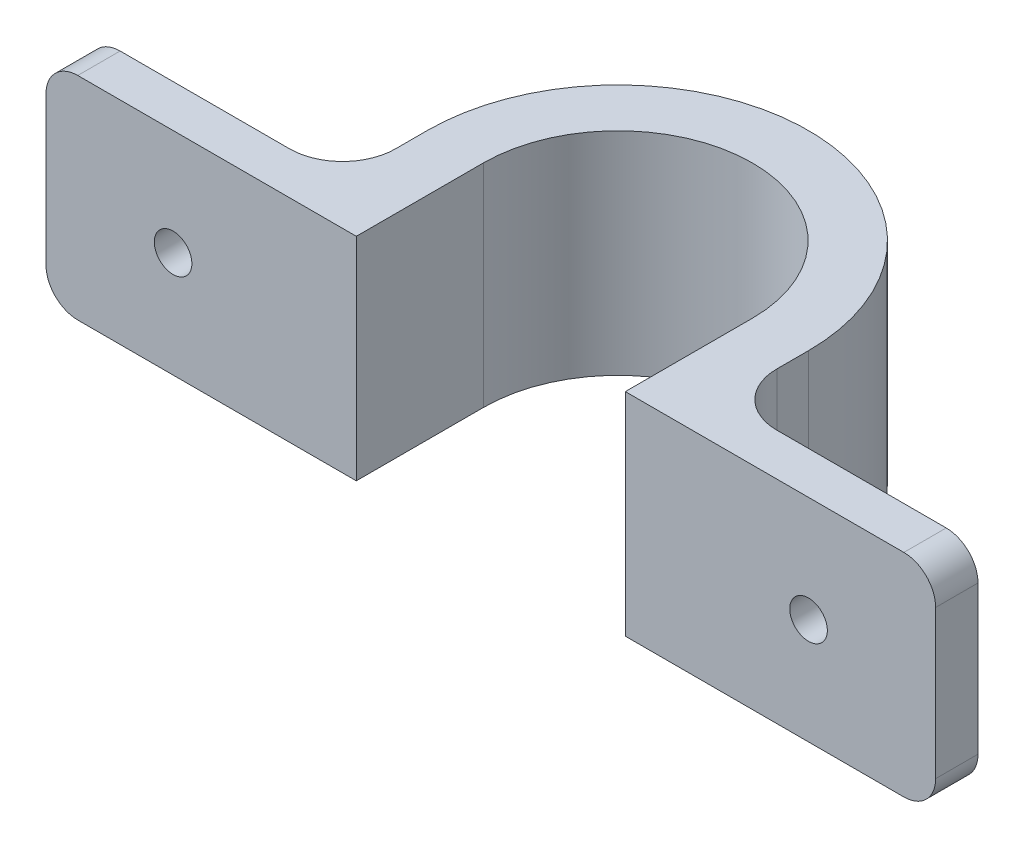
ISO-10303-21;
HEADER;
FILE_DESCRIPTION(('STEP AP214'),'2;1');
FILE_NAME('part.step','',(''),(''),'','','');
FILE_SCHEMA(('AUTOMOTIVE_DESIGN { 1 0 10303 214 1 1 1 1 }'));
ENDSEC;
DATA;
#1=APPLICATION_CONTEXT('core data for automotive mechanical design processes');
#2=APPLICATION_PROTOCOL_DEFINITION('international standard','automotive_design',2000,#1);
#3=PRODUCT_CONTEXT('',#1,'mechanical');
#4=PRODUCT('Part','Part','',(#3));
#5=PRODUCT_RELATED_PRODUCT_CATEGORY('part','',(#4));
#6=PRODUCT_DEFINITION_FORMATION('','',#4);
#7=PRODUCT_DEFINITION_CONTEXT('part definition',#1,'design');
#8=PRODUCT_DEFINITION('design','',#6,#7);
#9=PRODUCT_DEFINITION_SHAPE('','',#8);
#10=(LENGTH_UNIT() NAMED_UNIT(*) SI_UNIT(.MILLI.,.METRE.));
#11=(NAMED_UNIT(*) PLANE_ANGLE_UNIT() SI_UNIT($,.RADIAN.));
#12=(NAMED_UNIT(*) SI_UNIT($,.STERADIAN.) SOLID_ANGLE_UNIT());
#13=UNCERTAINTY_MEASURE_WITH_UNIT(LENGTH_MEASURE(1.E-05),#10,'distance_accuracy_value','');
#14=(GEOMETRIC_REPRESENTATION_CONTEXT(3) GLOBAL_UNCERTAINTY_ASSIGNED_CONTEXT((#13)) GLOBAL_UNIT_ASSIGNED_CONTEXT((#10,
#11,#12)) REPRESENTATION_CONTEXT('',''));
#15=CARTESIAN_POINT('',(0.,0.,0.));
#16=DIRECTION('',(0.,0.,1.));
#17=DIRECTION('',(1.,0.,0.));
#18=AXIS2_PLACEMENT_3D('',#15,#16,#17);
#19=CARTESIAN_POINT('',(29.3,20.,0.));
#20=DIRECTION('',(0.,0.,-1.));
#21=DIRECTION('',(-1.,0.,0.));
#22=AXIS2_PLACEMENT_3D('',#19,#20,#21);
#23=PLANE('',#22);
#24=CARTESIAN_POINT('',(12.,10.,0.));
#25=DIRECTION('',(0.,0.,-1.));
#26=DIRECTION('',(-1.,0.,0.));
#27=AXIS2_PLACEMENT_3D('',#24,#25,#26);
#28=CIRCLE('',#27,1.775);
#29=CARTESIAN_POINT('',(10.225,10.,0.));
#30=VERTEX_POINT('',#29);
#31=EDGE_CURVE('E388',#30,#30,#28,.T.);
#32=ORIENTED_EDGE('',*,*,#31,.T.);
#33=EDGE_LOOP('',(#32));
#34=FACE_BOUND('',#33,.T.);
#35=DIRECTION('',(0.,-1.,0.));
#36=VECTOR('',#35,1.);
#37=CARTESIAN_POINT('',(0.,20.,0.));
#38=LINE('',#37,#36);
#39=CARTESIAN_POINT('',(0.,17.,0.));
#40=VERTEX_POINT('',#39);
#41=CARTESIAN_POINT('',(0.,3.,0.));
#42=VERTEX_POINT('',#41);
#43=EDGE_CURVE('E324',#40,#42,#38,.T.);
#44=ORIENTED_EDGE('',*,*,#43,.T.);
#45=CARTESIAN_POINT('',(3.,3.,0.));
#46=DIRECTION('',(0.,0.,-1.));
#47=DIRECTION('',(-1.,0.,0.));
#48=AXIS2_PLACEMENT_3D('',#45,#46,#47);
#49=CIRCLE('',#48,3.);
#50=CARTESIAN_POINT('',(3.,0.,0.));
#51=VERTEX_POINT('',#50);
#52=EDGE_CURVE('E214',#42,#51,#49,.F.);
#53=ORIENTED_EDGE('',*,*,#52,.T.);
#54=DIRECTION('',(1.,0.,0.));
#55=VECTOR('',#54,1.);
#56=CARTESIAN_POINT('',(29.3,0.,0.));
#57=LINE('',#56,#55);
#58=CARTESIAN_POINT('',(29.3,0.,0.));
#59=VERTEX_POINT('',#58);
#60=EDGE_CURVE('E195',#51,#59,#57,.T.);
#61=ORIENTED_EDGE('',*,*,#60,.T.);
#62=DIRECTION('',(0.,-1.,0.));
#63=VECTOR('',#62,1.);
#64=CARTESIAN_POINT('',(29.3,20.,0.));
#65=LINE('',#64,#63);
#66=CARTESIAN_POINT('',(29.3,20.,0.));
#67=VERTEX_POINT('',#66);
#68=EDGE_CURVE('E186',#67,#59,#65,.T.);
#69=ORIENTED_EDGE('',*,*,#68,.F.);
#70=DIRECTION('',(1.,0.,0.));
#71=VECTOR('',#70,1.);
#72=CARTESIAN_POINT('',(29.3,20.,0.));
#73=LINE('',#72,#71);
#74=CARTESIAN_POINT('',(3.,20.,0.));
#75=VERTEX_POINT('',#74);
#76=EDGE_CURVE('E171',#75,#67,#73,.T.);
#77=ORIENTED_EDGE('',*,*,#76,.F.);
#78=CARTESIAN_POINT('',(3.,17.,0.));
#79=DIRECTION('',(0.,0.,-1.));
#80=DIRECTION('',(-1.,0.,0.));
#81=AXIS2_PLACEMENT_3D('',#78,#79,#80);
#82=CIRCLE('',#81,3.);
#83=EDGE_CURVE('E211',#75,#40,#82,.F.);
#84=ORIENTED_EDGE('',*,*,#83,.T.);
#85=EDGE_LOOP('',(#44,#53,#61,#69,#77,#84));
#86=FACE_BOUND('',#85,.T.);
#87=ADVANCED_FACE('F45',(#34,#86),#23,.F.);
#88=CARTESIAN_POINT('',(29.3,20.,-12.));
#89=DIRECTION('',(-1.,0.,0.));
#90=DIRECTION('',(0.,0.,1.));
#91=AXIS2_PLACEMENT_3D('',#88,#89,#90);
#92=PLANE('',#91);
#93=DIRECTION('',(0.,0.,-1.));
#94=VECTOR('',#93,1.);
#95=CARTESIAN_POINT('',(29.3,0.,-12.));
#96=LINE('',#95,#94);
#97=CARTESIAN_POINT('',(29.3,0.,-12.));
#98=VERTEX_POINT('',#97);
#99=EDGE_CURVE('E363',#59,#98,#96,.T.);
#100=ORIENTED_EDGE('',*,*,#99,.T.);
#101=DIRECTION('',(0.,-1.,0.));
#102=VECTOR('',#101,1.);
#103=CARTESIAN_POINT('',(29.3,20.,-12.));
#104=LINE('',#103,#102);
#105=CARTESIAN_POINT('',(29.3,20.,-12.));
#106=VERTEX_POINT('',#105);
#107=EDGE_CURVE('E188',#106,#98,#104,.T.);
#108=ORIENTED_EDGE('',*,*,#107,.F.);
#109=DIRECTION('',(0.,0.,-1.));
#110=VECTOR('',#109,1.);
#111=CARTESIAN_POINT('',(29.3,20.,-12.));
#112=LINE('',#111,#110);
#113=EDGE_CURVE('E174',#67,#106,#112,.T.);
#114=ORIENTED_EDGE('',*,*,#113,.F.);
#115=ORIENTED_EDGE('',*,*,#68,.T.);
#116=EDGE_LOOP('',(#100,#108,#114,#115));
#117=FACE_BOUND('',#116,.T.);
#118=ADVANCED_FACE('F185',(#117),#92,.F.);
#119=CARTESIAN_POINT('',(42.,20.,-12.));
#120=DIRECTION('',(0.,-1.,0.));
#121=DIRECTION('',(0.,0.,-1.));
#122=AXIS2_PLACEMENT_3D('',#119,#120,#121);
#123=CYLINDRICAL_SURFACE('',#122,12.7);
#124=CARTESIAN_POINT('',(42.,0.,-12.));
#125=DIRECTION('',(0.,-1.,0.));
#126=DIRECTION('',(0.,0.,1.));
#127=AXIS2_PLACEMENT_3D('',#124,#125,#126);
#128=CIRCLE('',#127,12.7);
#129=CARTESIAN_POINT('',(54.7,0.,-12.));
#130=VERTEX_POINT('',#129);
#131=EDGE_CURVE('E360',#98,#130,#128,.T.);
#132=ORIENTED_EDGE('',*,*,#131,.T.);
#133=DIRECTION('',(0.,-1.,0.));
#134=VECTOR('',#133,1.);
#135=CARTESIAN_POINT('',(54.7,20.,-12.));
#136=LINE('',#135,#134);
#137=CARTESIAN_POINT('',(54.7,20.,-12.));
#138=VERTEX_POINT('',#137);
#139=EDGE_CURVE('E204',#138,#130,#136,.T.);
#140=ORIENTED_EDGE('',*,*,#139,.F.);
#141=CARTESIAN_POINT('',(42.,20.,-12.));
#142=DIRECTION('',(0.,-1.,0.));
#143=DIRECTION('',(0.,0.,1.));
#144=AXIS2_PLACEMENT_3D('',#141,#142,#143);
#145=CIRCLE('',#144,12.7);
#146=EDGE_CURVE('E191',#106,#138,#145,.T.);
#147=ORIENTED_EDGE('',*,*,#146,.F.);
#148=ORIENTED_EDGE('',*,*,#107,.T.);
#149=EDGE_LOOP('',(#132,#140,#147,#148));
#150=FACE_BOUND('',#149,.T.);
#151=ADVANCED_FACE('F434',(#150),#123,.F.);
#152=CARTESIAN_POINT('',(54.7,20.,-12.));
#153=DIRECTION('',(1.,0.,0.));
#154=DIRECTION('',(0.,0.,-1.));
#155=AXIS2_PLACEMENT_3D('',#152,#153,#154);
#156=PLANE('',#155);
#157=DIRECTION('',(0.,0.,1.));
#158=VECTOR('',#157,1.);
#159=CARTESIAN_POINT('',(54.7,0.,-12.));
#160=LINE('',#159,#158);
#161=CARTESIAN_POINT('',(54.7,0.,0.));
#162=VERTEX_POINT('',#161);
#163=EDGE_CURVE('E313',#130,#162,#160,.T.);
#164=ORIENTED_EDGE('',*,*,#163,.T.);
#165=DIRECTION('',(0.,-1.,0.));
#166=VECTOR('',#165,1.);
#167=CARTESIAN_POINT('',(54.7,20.,0.));
#168=LINE('',#167,#166);
#169=CARTESIAN_POINT('',(54.7,20.,0.));
#170=VERTEX_POINT('',#169);
#171=EDGE_CURVE('E345',#170,#162,#168,.T.);
#172=ORIENTED_EDGE('',*,*,#171,.F.);
#173=DIRECTION('',(0.,0.,1.));
#174=VECTOR('',#173,1.);
#175=CARTESIAN_POINT('',(54.7,20.,-12.));
#176=LINE('',#175,#174);
#177=EDGE_CURVE('E356',#138,#170,#176,.T.);
#178=ORIENTED_EDGE('',*,*,#177,.F.);
#179=ORIENTED_EDGE('',*,*,#139,.T.);
#180=EDGE_LOOP('',(#164,#172,#178,#179));
#181=FACE_BOUND('',#180,.T.);
#182=ADVANCED_FACE('F354',(#181),#156,.F.);
#183=CARTESIAN_POINT('',(54.7,20.,0.));
#184=DIRECTION('',(0.,0.,-1.));
#185=DIRECTION('',(-1.,0.,0.));
#186=AXIS2_PLACEMENT_3D('',#183,#184,#185);
#187=PLANE('',#186);
#188=CARTESIAN_POINT('',(72.,10.,0.));
#189=DIRECTION('',(0.,0.,-1.));
#190=DIRECTION('',(-1.,0.,0.));
#191=AXIS2_PLACEMENT_3D('',#188,#189,#190);
#192=CIRCLE('',#191,1.775);
#193=CARTESIAN_POINT('',(70.225,10.,0.));
#194=VERTEX_POINT('',#193);
#195=EDGE_CURVE('E370',#194,#194,#192,.T.);
#196=ORIENTED_EDGE('',*,*,#195,.T.);
#197=EDGE_LOOP('',(#196));
#198=FACE_BOUND('',#197,.T.);
#199=DIRECTION('',(1.,0.,0.));
#200=VECTOR('',#199,1.);
#201=CARTESIAN_POINT('',(54.7,0.,0.));
#202=LINE('',#201,#200);
#203=CARTESIAN_POINT('',(81.,0.,0.));
#204=VERTEX_POINT('',#203);
#205=EDGE_CURVE('E306',#162,#204,#202,.T.);
#206=ORIENTED_EDGE('',*,*,#205,.T.);
#207=CARTESIAN_POINT('',(81.,3.,0.));
#208=DIRECTION('',(0.,0.,-1.));
#209=DIRECTION('',(-1.,0.,0.));
#210=AXIS2_PLACEMENT_3D('',#207,#208,#209);
#211=CIRCLE('',#210,3.);
#212=CARTESIAN_POINT('',(84.,3.,0.));
#213=VERTEX_POINT('',#212);
#214=EDGE_CURVE('E253',#204,#213,#211,.F.);
#215=ORIENTED_EDGE('',*,*,#214,.T.);
#216=DIRECTION('',(0.,-1.,0.));
#217=VECTOR('',#216,1.);
#218=CARTESIAN_POINT('',(84.,20.,0.));
#219=LINE('',#218,#217);
#220=CARTESIAN_POINT('',(84.,17.,0.));
#221=VERTEX_POINT('',#220);
#222=EDGE_CURVE('E341',#221,#213,#219,.T.);
#223=ORIENTED_EDGE('',*,*,#222,.F.);
#224=CARTESIAN_POINT('',(81.,17.,0.));
#225=DIRECTION('',(0.,0.,-1.));
#226=DIRECTION('',(-1.,0.,0.));
#227=AXIS2_PLACEMENT_3D('',#224,#225,#226);
#228=CIRCLE('',#227,3.);
#229=CARTESIAN_POINT('',(81.,20.,0.));
#230=VERTEX_POINT('',#229);
#231=EDGE_CURVE('E250',#221,#230,#228,.F.);
#232=ORIENTED_EDGE('',*,*,#231,.T.);
#233=DIRECTION('',(1.,0.,0.));
#234=VECTOR('',#233,1.);
#235=CARTESIAN_POINT('',(54.7,20.,0.));
#236=LINE('',#235,#234);
#237=EDGE_CURVE('E380',#170,#230,#236,.T.);
#238=ORIENTED_EDGE('',*,*,#237,.F.);
#239=ORIENTED_EDGE('',*,*,#171,.T.);
#240=EDGE_LOOP('',(#206,#215,#223,#232,#238,#239));
#241=FACE_BOUND('',#240,.T.);
#242=ADVANCED_FACE('F404',(#198,#241),#187,.F.);
#243=CARTESIAN_POINT('',(84.,20.,-4.00000000000001));
#244=DIRECTION('',(-1.,0.,0.));
#245=DIRECTION('',(0.,0.,1.));
#246=AXIS2_PLACEMENT_3D('',#243,#244,#245);
#247=PLANE('',#246);
#248=ORIENTED_EDGE('',*,*,#222,.T.);
#249=DIRECTION('',(0.,0.,-1.));
#250=VECTOR('',#249,1.);
#251=CARTESIAN_POINT('',(84.,3.,-4.00000000000001));
#252=LINE('',#251,#250);
#253=CARTESIAN_POINT('',(84.,3.,-4.00000000000001));
#254=VERTEX_POINT('',#253);
#255=EDGE_CURVE('E240',#213,#254,#252,.T.);
#256=ORIENTED_EDGE('',*,*,#255,.T.);
#257=DIRECTION('',(0.,-1.,0.));
#258=VECTOR('',#257,1.);
#259=CARTESIAN_POINT('',(84.,20.,-4.00000000000001));
#260=LINE('',#259,#258);
#261=CARTESIAN_POINT('',(84.,17.,-4.00000000000001));
#262=VERTEX_POINT('',#261);
#263=EDGE_CURVE('E338',#262,#254,#260,.T.);
#264=ORIENTED_EDGE('',*,*,#263,.F.);
#265=DIRECTION('',(0.,0.,-1.));
#266=VECTOR('',#265,1.);
#267=CARTESIAN_POINT('',(84.,17.,0.));
#268=LINE('',#267,#266);
#269=EDGE_CURVE('E237',#262,#221,#268,.F.);
#270=ORIENTED_EDGE('',*,*,#269,.T.);
#271=EDGE_LOOP('',(#248,#256,#264,#270));
#272=FACE_BOUND('',#271,.T.);
#273=ADVANCED_FACE('F416',(#272),#247,.F.);
#274=CARTESIAN_POINT('',(60.,20.,-4.));
#275=DIRECTION('',(0.,0.,1.));
#276=DIRECTION('',(1.,0.,0.));
#277=AXIS2_PLACEMENT_3D('',#274,#275,#276);
#278=PLANE('',#277);
#279=CARTESIAN_POINT('',(72.,10.,-4.));
#280=DIRECTION('',(0.,0.,-1.));
#281=DIRECTION('',(-1.,0.,0.));
#282=AXIS2_PLACEMENT_3D('',#279,#280,#281);
#283=CIRCLE('',#282,1.775);
#284=CARTESIAN_POINT('',(70.225,10.,-4.));
#285=VERTEX_POINT('',#284);
#286=EDGE_CURVE('E396',#285,#285,#283,.T.);
#287=ORIENTED_EDGE('',*,*,#286,.F.);
#288=EDGE_LOOP('',(#287));
#289=FACE_BOUND('',#288,.T.);
#290=DIRECTION('',(-1.,0.,0.));
#291=VECTOR('',#290,1.);
#292=CARTESIAN_POINT('',(60.,0.,-4.));
#293=LINE('',#292,#291);
#294=CARTESIAN_POINT('',(81.,0.,-4.));
#295=VERTEX_POINT('',#294);
#296=CARTESIAN_POINT('',(65.,0.,-4.));
#297=VERTEX_POINT('',#296);
#298=EDGE_CURVE('E298',#295,#297,#293,.T.);
#299=ORIENTED_EDGE('',*,*,#298,.T.);
#300=DIRECTION('',(0.,-1.,0.));
#301=VECTOR('',#300,1.);
#302=CARTESIAN_POINT('',(65.,20.,-4.));
#303=LINE('',#302,#301);
#304=CARTESIAN_POINT('',(65.,20.,-4.));
#305=VERTEX_POINT('',#304);
#306=EDGE_CURVE('E260',#297,#305,#303,.F.);
#307=ORIENTED_EDGE('',*,*,#306,.T.);
#308=DIRECTION('',(-1.,0.,0.));
#309=VECTOR('',#308,1.);
#310=CARTESIAN_POINT('',(60.,20.,-4.));
#311=LINE('',#310,#309);
#312=CARTESIAN_POINT('',(81.,20.,-4.));
#313=VERTEX_POINT('',#312);
#314=EDGE_CURVE('E281',#313,#305,#311,.T.);
#315=ORIENTED_EDGE('',*,*,#314,.F.);
#316=CARTESIAN_POINT('',(81.,17.,-4.00000000000001));
#317=DIRECTION('',(0.,0.,1.));
#318=DIRECTION('',(1.,0.,0.));
#319=AXIS2_PLACEMENT_3D('',#316,#317,#318);
#320=CIRCLE('',#319,3.);
#321=EDGE_CURVE('E244',#313,#262,#320,.F.);
#322=ORIENTED_EDGE('',*,*,#321,.T.);
#323=ORIENTED_EDGE('',*,*,#263,.T.);
#324=CARTESIAN_POINT('',(81.,3.,-4.));
#325=DIRECTION('',(0.,0.,1.));
#326=DIRECTION('',(1.,0.,0.));
#327=AXIS2_PLACEMENT_3D('',#324,#325,#326);
#328=CIRCLE('',#327,3.);
#329=EDGE_CURVE('E247',#254,#295,#328,.F.);
#330=ORIENTED_EDGE('',*,*,#329,.T.);
#331=EDGE_LOOP('',(#299,#307,#315,#322,#323,#330));
#332=FACE_BOUND('',#331,.T.);
#333=ADVANCED_FACE('F303',(#289,#332),#278,.F.);
#334=CARTESIAN_POINT('',(60.,20.,-12.));
#335=DIRECTION('',(-1.,0.,0.));
#336=DIRECTION('',(0.,0.,1.));
#337=AXIS2_PLACEMENT_3D('',#334,#335,#336);
#338=PLANE('',#337);
#339=DIRECTION('',(0.,0.,-1.));
#340=VECTOR('',#339,1.);
#341=CARTESIAN_POINT('',(60.,20.,-12.));
#342=LINE('',#341,#340);
#343=CARTESIAN_POINT('',(60.,20.,-9.));
#344=VERTEX_POINT('',#343);
#345=CARTESIAN_POINT('',(60.,20.,-12.));
#346=VERTEX_POINT('',#345);
#347=EDGE_CURVE('E278',#344,#346,#342,.T.);
#348=ORIENTED_EDGE('',*,*,#347,.F.);
#349=DIRECTION('',(0.,-1.,0.));
#350=VECTOR('',#349,1.);
#351=CARTESIAN_POINT('',(60.,0.,-9.));
#352=LINE('',#351,#350);
#353=CARTESIAN_POINT('',(60.,0.,-9.));
#354=VERTEX_POINT('',#353);
#355=EDGE_CURVE('E256',#344,#354,#352,.T.);
#356=ORIENTED_EDGE('',*,*,#355,.T.);
#357=DIRECTION('',(0.,0.,-1.));
#358=VECTOR('',#357,1.);
#359=CARTESIAN_POINT('',(60.,0.,-12.));
#360=LINE('',#359,#358);
#361=CARTESIAN_POINT('',(60.,0.,-12.));
#362=VERTEX_POINT('',#361);
#363=EDGE_CURVE('E301',#354,#362,#360,.T.);
#364=ORIENTED_EDGE('',*,*,#363,.T.);
#365=DIRECTION('',(0.,-1.,0.));
#366=VECTOR('',#365,1.);
#367=CARTESIAN_POINT('',(60.,20.,-12.));
#368=LINE('',#367,#366);
#369=EDGE_CURVE('E289',#346,#362,#368,.T.);
#370=ORIENTED_EDGE('',*,*,#369,.F.);
#371=EDGE_LOOP('',(#348,#356,#364,#370));
#372=FACE_BOUND('',#371,.T.);
#373=ADVANCED_FACE('F286',(#372),#338,.F.);
#374=CARTESIAN_POINT('',(42.,20.,-12.));
#375=DIRECTION('',(0.,-1.,0.));
#376=DIRECTION('',(0.,0.,-1.));
#377=AXIS2_PLACEMENT_3D('',#374,#375,#376);
#378=CYLINDRICAL_SURFACE('',#377,18.);
#379=CARTESIAN_POINT('',(42.,0.,-12.));
#380=DIRECTION('',(0.,1.,0.));
#381=DIRECTION('',(0.,0.,1.));
#382=AXIS2_PLACEMENT_3D('',#379,#380,#381);
#383=CIRCLE('',#382,18.);
#384=CARTESIAN_POINT('',(24.,0.,-12.));
#385=VERTEX_POINT('',#384);
#386=EDGE_CURVE('E310',#362,#385,#383,.T.);
#387=ORIENTED_EDGE('',*,*,#386,.T.);
#388=DIRECTION('',(0.,-1.,0.));
#389=VECTOR('',#388,1.);
#390=CARTESIAN_POINT('',(24.,20.,-12.));
#391=LINE('',#390,#389);
#392=CARTESIAN_POINT('',(24.,20.,-12.));
#393=VERTEX_POINT('',#392);
#394=EDGE_CURVE('E332',#393,#385,#391,.T.);
#395=ORIENTED_EDGE('',*,*,#394,.F.);
#396=CARTESIAN_POINT('',(42.,20.,-12.));
#397=DIRECTION('',(0.,1.,0.));
#398=DIRECTION('',(0.,0.,1.));
#399=AXIS2_PLACEMENT_3D('',#396,#397,#398);
#400=CIRCLE('',#399,18.);
#401=EDGE_CURVE('E292',#346,#393,#400,.T.);
#402=ORIENTED_EDGE('',*,*,#401,.F.);
#403=ORIENTED_EDGE('',*,*,#369,.T.);
#404=EDGE_LOOP('',(#387,#395,#402,#403));
#405=FACE_BOUND('',#404,.T.);
#406=ADVANCED_FACE('F422',(#405),#378,.T.);
#407=CARTESIAN_POINT('',(24.,20.,-12.));
#408=DIRECTION('',(1.,0.,0.));
#409=DIRECTION('',(0.,0.,-1.));
#410=AXIS2_PLACEMENT_3D('',#407,#408,#409);
#411=PLANE('',#410);
#412=DIRECTION('',(0.,0.,1.));
#413=VECTOR('',#412,1.);
#414=CARTESIAN_POINT('',(24.,0.,-12.));
#415=LINE('',#414,#413);
#416=CARTESIAN_POINT('',(24.,0.,-9.00000000000001));
#417=VERTEX_POINT('',#416);
#418=EDGE_CURVE('E319',#385,#417,#415,.T.);
#419=ORIENTED_EDGE('',*,*,#418,.T.);
#420=DIRECTION('',(0.,-1.,0.));
#421=VECTOR('',#420,1.);
#422=CARTESIAN_POINT('',(24.,20.,-9.00000000000001));
#423=LINE('',#422,#421);
#424=CARTESIAN_POINT('',(24.,20.,-9.00000000000001));
#425=VERTEX_POINT('',#424);
#426=EDGE_CURVE('E61',#417,#425,#423,.F.);
#427=ORIENTED_EDGE('',*,*,#426,.T.);
#428=DIRECTION('',(0.,0.,1.));
#429=VECTOR('',#428,1.);
#430=CARTESIAN_POINT('',(24.,20.,-12.));
#431=LINE('',#430,#429);
#432=EDGE_CURVE('E373',#393,#425,#431,.T.);
#433=ORIENTED_EDGE('',*,*,#432,.F.);
#434=ORIENTED_EDGE('',*,*,#394,.T.);
#435=EDGE_LOOP('',(#419,#427,#433,#434));
#436=FACE_BOUND('',#435,.T.);
#437=ADVANCED_FACE('F503',(#436),#411,.F.);
#438=CARTESIAN_POINT('',(0.,20.,-4.));
#439=DIRECTION('',(0.,0.,1.));
#440=DIRECTION('',(1.,0.,0.));
#441=AXIS2_PLACEMENT_3D('',#438,#439,#440);
#442=PLANE('',#441);
#443=CARTESIAN_POINT('',(12.,10.,-4.));
#444=DIRECTION('',(0.,0.,-1.));
#445=DIRECTION('',(-1.,0.,0.));
#446=AXIS2_PLACEMENT_3D('',#443,#444,#445);
#447=CIRCLE('',#446,1.775);
#448=CARTESIAN_POINT('',(10.225,10.,-4.));
#449=VERTEX_POINT('',#448);
#450=EDGE_CURVE('E392',#449,#449,#447,.T.);
#451=ORIENTED_EDGE('',*,*,#450,.F.);
#452=EDGE_LOOP('',(#451));
#453=FACE_BOUND('',#452,.T.);
#454=DIRECTION('',(-1.,0.,0.));
#455=VECTOR('',#454,1.);
#456=CARTESIAN_POINT('',(0.,20.,-4.));
#457=LINE('',#456,#455);
#458=CARTESIAN_POINT('',(19.,20.,-4.));
#459=VERTEX_POINT('',#458);
#460=CARTESIAN_POINT('',(3.,20.,-4.));
#461=VERTEX_POINT('',#460);
#462=EDGE_CURVE('E328',#459,#461,#457,.T.);
#463=ORIENTED_EDGE('',*,*,#462,.F.);
#464=DIRECTION('',(0.,-1.,0.));
#465=VECTOR('',#464,1.);
#466=CARTESIAN_POINT('',(19.,0.,-4.));
#467=LINE('',#466,#465);
#468=CARTESIAN_POINT('',(19.,0.,-4.));
#469=VERTEX_POINT('',#468);
#470=EDGE_CURVE('E263',#459,#469,#467,.T.);
#471=ORIENTED_EDGE('',*,*,#470,.T.);
#472=DIRECTION('',(-1.,0.,0.));
#473=VECTOR('',#472,1.);
#474=CARTESIAN_POINT('',(0.,0.,-4.));
#475=LINE('',#474,#473);
#476=CARTESIAN_POINT('',(3.,0.,-4.));
#477=VERTEX_POINT('',#476);
#478=EDGE_CURVE('E181',#469,#477,#475,.T.);
#479=ORIENTED_EDGE('',*,*,#478,.T.);
#480=CARTESIAN_POINT('',(3.,3.,-4.));
#481=DIRECTION('',(0.,0.,1.));
#482=DIRECTION('',(1.,0.,0.));
#483=AXIS2_PLACEMENT_3D('',#480,#481,#482);
#484=CIRCLE('',#483,3.);
#485=CARTESIAN_POINT('',(0.,3.,-4.));
#486=VERTEX_POINT('',#485);
#487=EDGE_CURVE('E228',#477,#486,#484,.F.);
#488=ORIENTED_EDGE('',*,*,#487,.T.);
#489=DIRECTION('',(0.,-1.,0.));
#490=VECTOR('',#489,1.);
#491=CARTESIAN_POINT('',(0.,20.,-4.));
#492=LINE('',#491,#490);
#493=CARTESIAN_POINT('',(0.,17.,-4.));
#494=VERTEX_POINT('',#493);
#495=EDGE_CURVE('E327',#494,#486,#492,.T.);
#496=ORIENTED_EDGE('',*,*,#495,.F.);
#497=CARTESIAN_POINT('',(3.,17.,-4.));
#498=DIRECTION('',(0.,0.,1.));
#499=DIRECTION('',(1.,0.,0.));
#500=AXIS2_PLACEMENT_3D('',#497,#498,#499);
#501=CIRCLE('',#500,3.);
#502=EDGE_CURVE('E224',#494,#461,#501,.F.);
#503=ORIENTED_EDGE('',*,*,#502,.T.);
#504=EDGE_LOOP('',(#463,#471,#479,#488,#496,#503));
#505=FACE_BOUND('',#504,.T.);
#506=ADVANCED_FACE('F463',(#453,#505),#442,.F.);
#507=CARTESIAN_POINT('',(0.,20.,0.));
#508=DIRECTION('',(1.,0.,0.));
#509=DIRECTION('',(0.,0.,-1.));
#510=AXIS2_PLACEMENT_3D('',#507,#508,#509);
#511=PLANE('',#510);
#512=ORIENTED_EDGE('',*,*,#495,.T.);
#513=DIRECTION('',(0.,0.,1.));
#514=VECTOR('',#513,1.);
#515=CARTESIAN_POINT('',(0.,3.,0.));
#516=LINE('',#515,#514);
#517=EDGE_CURVE('E202',#486,#42,#516,.T.);
#518=ORIENTED_EDGE('',*,*,#517,.T.);
#519=ORIENTED_EDGE('',*,*,#43,.F.);
#520=DIRECTION('',(0.,0.,1.));
#521=VECTOR('',#520,1.);
#522=CARTESIAN_POINT('',(0.,17.,-4.));
#523=LINE('',#522,#521);
#524=EDGE_CURVE('E198',#40,#494,#523,.F.);
#525=ORIENTED_EDGE('',*,*,#524,.T.);
#526=EDGE_LOOP('',(#512,#518,#519,#525));
#527=FACE_BOUND('',#526,.T.);
#528=ADVANCED_FACE('F469',(#527),#511,.F.);
#529=CARTESIAN_POINT('',(42.,20.,-12.));
#530=DIRECTION('',(0.,1.,0.));
#531=DIRECTION('',(0.,0.,1.));
#532=AXIS2_PLACEMENT_3D('',#529,#530,#531);
#533=PLANE('',#532);
#534=ORIENTED_EDGE('',*,*,#432,.T.);
#535=CARTESIAN_POINT('',(19.,20.,-9.));
#536=DIRECTION('',(0.,1.,0.));
#537=DIRECTION('',(0.,0.,1.));
#538=AXIS2_PLACEMENT_3D('',#535,#536,#537);
#539=CIRCLE('',#538,5.);
#540=EDGE_CURVE('E11',#425,#459,#539,.F.);
#541=ORIENTED_EDGE('',*,*,#540,.T.);
#542=ORIENTED_EDGE('',*,*,#462,.T.);
#543=DIRECTION('',(0.,0.,1.));
#544=VECTOR('',#543,1.);
#545=CARTESIAN_POINT('',(3.,20.,0.));
#546=LINE('',#545,#544);
#547=EDGE_CURVE('E177',#461,#75,#546,.T.);
#548=ORIENTED_EDGE('',*,*,#547,.T.);
#549=ORIENTED_EDGE('',*,*,#76,.T.);
#550=ORIENTED_EDGE('',*,*,#113,.T.);
#551=ORIENTED_EDGE('',*,*,#146,.T.);
#552=ORIENTED_EDGE('',*,*,#177,.T.);
#553=ORIENTED_EDGE('',*,*,#237,.T.);
#554=DIRECTION('',(0.,0.,-1.));
#555=VECTOR('',#554,1.);
#556=CARTESIAN_POINT('',(81.,20.,-4.00000000000001));
#557=LINE('',#556,#555);
#558=EDGE_CURVE('E231',#230,#313,#557,.T.);
#559=ORIENTED_EDGE('',*,*,#558,.T.);
#560=ORIENTED_EDGE('',*,*,#314,.T.);
#561=CARTESIAN_POINT('',(65.,20.,-9.));
#562=DIRECTION('',(0.,1.,0.));
#563=DIRECTION('',(0.,0.,1.));
#564=AXIS2_PLACEMENT_3D('',#561,#562,#563);
#565=CIRCLE('',#564,5.);
#566=EDGE_CURVE('E272',#305,#344,#565,.F.);
#567=ORIENTED_EDGE('',*,*,#566,.T.);
#568=ORIENTED_EDGE('',*,*,#347,.T.);
#569=ORIENTED_EDGE('',*,*,#401,.T.);
#570=EDGE_LOOP('',(#534,#541,#542,#548,#549,#550,#551,#552,#553,#559,#560,#567,#568,#569));
#571=FACE_BOUND('',#570,.T.);
#572=ADVANCED_FACE('F173',(#571),#533,.T.);
#573=CARTESIAN_POINT('',(42.,0.,-12.));
#574=DIRECTION('',(0.,1.,0.));
#575=DIRECTION('',(0.,0.,1.));
#576=AXIS2_PLACEMENT_3D('',#573,#574,#575);
#577=PLANE('',#576);
#578=ORIENTED_EDGE('',*,*,#60,.F.);
#579=DIRECTION('',(0.,0.,1.));
#580=VECTOR('',#579,1.);
#581=CARTESIAN_POINT('',(3.,0.,-12.));
#582=LINE('',#581,#580);
#583=EDGE_CURVE('E220',#51,#477,#582,.F.);
#584=ORIENTED_EDGE('',*,*,#583,.T.);
#585=ORIENTED_EDGE('',*,*,#478,.F.);
#586=CARTESIAN_POINT('',(19.,0.,-9.));
#587=DIRECTION('',(0.,1.,0.));
#588=DIRECTION('',(0.,0.,1.));
#589=AXIS2_PLACEMENT_3D('',#586,#587,#588);
#590=CIRCLE('',#589,5.);
#591=EDGE_CURVE('E54',#469,#417,#590,.T.);
#592=ORIENTED_EDGE('',*,*,#591,.T.);
#593=ORIENTED_EDGE('',*,*,#418,.F.);
#594=ORIENTED_EDGE('',*,*,#386,.F.);
#595=ORIENTED_EDGE('',*,*,#363,.F.);
#596=CARTESIAN_POINT('',(65.,0.,-9.));
#597=DIRECTION('',(0.,1.,0.));
#598=DIRECTION('',(0.,0.,1.));
#599=AXIS2_PLACEMENT_3D('',#596,#597,#598);
#600=CIRCLE('',#599,5.);
#601=EDGE_CURVE('E269',#354,#297,#600,.T.);
#602=ORIENTED_EDGE('',*,*,#601,.T.);
#603=ORIENTED_EDGE('',*,*,#298,.F.);
#604=DIRECTION('',(0.,0.,-1.));
#605=VECTOR('',#604,1.);
#606=CARTESIAN_POINT('',(81.,0.,-12.));
#607=LINE('',#606,#605);
#608=EDGE_CURVE('E217',#295,#204,#607,.F.);
#609=ORIENTED_EDGE('',*,*,#608,.T.);
#610=ORIENTED_EDGE('',*,*,#205,.F.);
#611=ORIENTED_EDGE('',*,*,#163,.F.);
#612=ORIENTED_EDGE('',*,*,#131,.F.);
#613=ORIENTED_EDGE('',*,*,#99,.F.);
#614=EDGE_LOOP('',(#578,#584,#585,#592,#593,#594,#595,#602,#603,#609,#610,#611,#612,#613));
#615=FACE_BOUND('',#614,.T.);
#616=ADVANCED_FACE('F297',(#615),#577,.F.);
#617=CARTESIAN_POINT('',(12.,10.,0.));
#618=DIRECTION('',(0.,0.,-1.));
#619=DIRECTION('',(-1.,0.,0.));
#620=AXIS2_PLACEMENT_3D('',#617,#618,#619);
#621=CYLINDRICAL_SURFACE('',#620,1.775);
#622=ORIENTED_EDGE('',*,*,#31,.F.);
#623=EDGE_LOOP('',(#622));
#624=FACE_BOUND('',#623,.T.);
#625=ORIENTED_EDGE('',*,*,#450,.T.);
#626=EDGE_LOOP('',(#625));
#627=FACE_BOUND('',#626,.T.);
#628=ADVANCED_FACE('F411',(#624,#627),#621,.F.);
#629=CARTESIAN_POINT('',(72.,10.,0.));
#630=DIRECTION('',(0.,0.,-1.));
#631=DIRECTION('',(-1.,0.,0.));
#632=AXIS2_PLACEMENT_3D('',#629,#630,#631);
#633=CYLINDRICAL_SURFACE('',#632,1.775);
#634=ORIENTED_EDGE('',*,*,#195,.F.);
#635=EDGE_LOOP('',(#634));
#636=FACE_BOUND('',#635,.T.);
#637=ORIENTED_EDGE('',*,*,#286,.T.);
#638=EDGE_LOOP('',(#637));
#639=FACE_BOUND('',#638,.T.);
#640=ADVANCED_FACE('F407',(#636,#639),#633,.F.);
#641=CARTESIAN_POINT('',(3.,3.,0.));
#642=DIRECTION('',(0.,0.,1.));
#643=DIRECTION('',(1.,0.,0.));
#644=AXIS2_PLACEMENT_3D('',#641,#642,#643);
#645=CYLINDRICAL_SURFACE('',#644,3.);
#646=ORIENTED_EDGE('',*,*,#487,.F.);
#647=ORIENTED_EDGE('',*,*,#583,.F.);
#648=ORIENTED_EDGE('',*,*,#52,.F.);
#649=ORIENTED_EDGE('',*,*,#517,.F.);
#650=EDGE_LOOP('',(#646,#647,#648,#649));
#651=FACE_BOUND('',#650,.T.);
#652=ADVANCED_FACE('F410',(#651),#645,.T.);
#653=CARTESIAN_POINT('',(3.,17.,-12.));
#654=DIRECTION('',(0.,0.,-1.));
#655=DIRECTION('',(-1.,0.,0.));
#656=AXIS2_PLACEMENT_3D('',#653,#654,#655);
#657=CYLINDRICAL_SURFACE('',#656,3.);
#658=ORIENTED_EDGE('',*,*,#502,.F.);
#659=ORIENTED_EDGE('',*,*,#524,.F.);
#660=ORIENTED_EDGE('',*,*,#83,.F.);
#661=ORIENTED_EDGE('',*,*,#547,.F.);
#662=EDGE_LOOP('',(#658,#659,#660,#661));
#663=FACE_BOUND('',#662,.T.);
#664=ADVANCED_FACE('F440',(#663),#657,.T.);
#665=CARTESIAN_POINT('',(81.,3.,-4.00000000000001));
#666=DIRECTION('',(0.,0.,-1.));
#667=DIRECTION('',(-1.,0.,0.));
#668=AXIS2_PLACEMENT_3D('',#665,#666,#667);
#669=CYLINDRICAL_SURFACE('',#668,3.);
#670=ORIENTED_EDGE('',*,*,#214,.F.);
#671=ORIENTED_EDGE('',*,*,#608,.F.);
#672=ORIENTED_EDGE('',*,*,#329,.F.);
#673=ORIENTED_EDGE('',*,*,#255,.F.);
#674=EDGE_LOOP('',(#670,#671,#672,#673));
#675=FACE_BOUND('',#674,.T.);
#676=ADVANCED_FACE('F444',(#675),#669,.T.);
#677=CARTESIAN_POINT('',(81.,17.,-12.));
#678=DIRECTION('',(0.,0.,1.));
#679=DIRECTION('',(1.,0.,0.));
#680=AXIS2_PLACEMENT_3D('',#677,#678,#679);
#681=CYLINDRICAL_SURFACE('',#680,3.);
#682=ORIENTED_EDGE('',*,*,#231,.F.);
#683=ORIENTED_EDGE('',*,*,#269,.F.);
#684=ORIENTED_EDGE('',*,*,#321,.F.);
#685=ORIENTED_EDGE('',*,*,#558,.F.);
#686=EDGE_LOOP('',(#682,#683,#684,#685));
#687=FACE_BOUND('',#686,.T.);
#688=ADVANCED_FACE('F448',(#687),#681,.T.);
#689=CARTESIAN_POINT('',(65.,20.,-9.));
#690=DIRECTION('',(0.,1.,0.));
#691=DIRECTION('',(0.,0.,1.));
#692=AXIS2_PLACEMENT_3D('',#689,#690,#691);
#693=CYLINDRICAL_SURFACE('',#692,5.);
#694=ORIENTED_EDGE('',*,*,#566,.F.);
#695=ORIENTED_EDGE('',*,*,#306,.F.);
#696=ORIENTED_EDGE('',*,*,#601,.F.);
#697=ORIENTED_EDGE('',*,*,#355,.F.);
#698=EDGE_LOOP('',(#694,#695,#696,#697));
#699=FACE_BOUND('',#698,.T.);
#700=ADVANCED_FACE('F294',(#699),#693,.F.);
#701=CARTESIAN_POINT('',(19.,20.,-9.));
#702=DIRECTION('',(0.,1.,0.));
#703=DIRECTION('',(0.,0.,1.));
#704=AXIS2_PLACEMENT_3D('',#701,#702,#703);
#705=CYLINDRICAL_SURFACE('',#704,5.);
#706=ORIENTED_EDGE('',*,*,#540,.F.);
#707=ORIENTED_EDGE('',*,*,#426,.F.);
#708=ORIENTED_EDGE('',*,*,#591,.F.);
#709=ORIENTED_EDGE('',*,*,#470,.F.);
#710=EDGE_LOOP('',(#706,#707,#708,#709));
#711=FACE_BOUND('',#710,.T.);
#712=ADVANCED_FACE('F47',(#711),#705,.F.);
#713=CLOSED_SHELL('',(#87,#118,#151,#182,#242,#273,#333,#373,#406,#437,#506,#528,#572,#616,#628,
#640,#652,#664,#676,#688,#700,#712));
#714=MANIFOLD_SOLID_BREP('B2',#713);
#715=ADVANCED_BREP_SHAPE_REPRESENTATION('',(#18,#714),#14);
#716=SHAPE_DEFINITION_REPRESENTATION(#9,#715);
ENDSEC;
END-ISO-10303-21;
